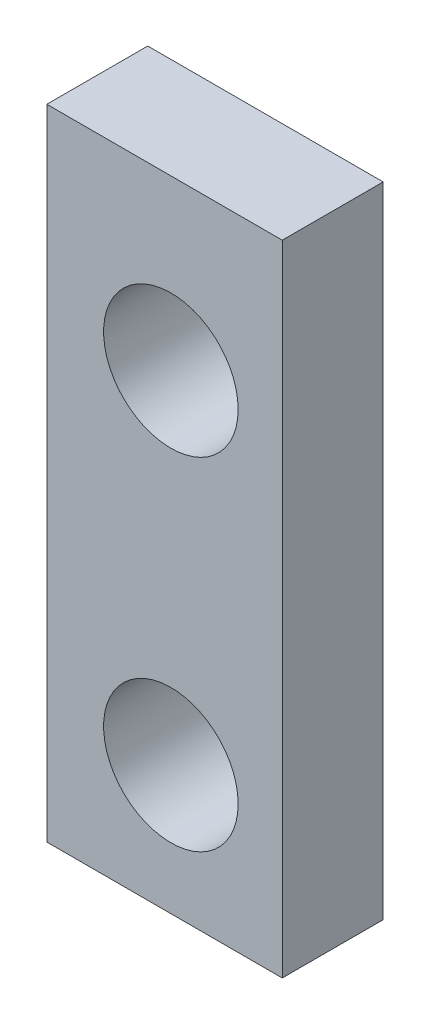
ISO-10303-21;
HEADER;
FILE_DESCRIPTION(('STEP AP214'),'2;1');
FILE_NAME('part.step','',(''),(''),'','','');
FILE_SCHEMA(('AUTOMOTIVE_DESIGN { 1 0 10303 214 1 1 1 1 }'));
ENDSEC;
DATA;
#1=APPLICATION_CONTEXT('core data for automotive mechanical design processes');
#2=APPLICATION_PROTOCOL_DEFINITION('international standard','automotive_design',2000,#1);
#3=PRODUCT_CONTEXT('',#1,'mechanical');
#4=PRODUCT('Part','Part','',(#3));
#5=PRODUCT_RELATED_PRODUCT_CATEGORY('part','',(#4));
#6=PRODUCT_DEFINITION_FORMATION('','',#4);
#7=PRODUCT_DEFINITION_CONTEXT('part definition',#1,'design');
#8=PRODUCT_DEFINITION('design','',#6,#7);
#9=PRODUCT_DEFINITION_SHAPE('','',#8);
#10=(LENGTH_UNIT() NAMED_UNIT(*) SI_UNIT(.MILLI.,.METRE.));
#11=(NAMED_UNIT(*) PLANE_ANGLE_UNIT() SI_UNIT($,.RADIAN.));
#12=(NAMED_UNIT(*) SI_UNIT($,.STERADIAN.) SOLID_ANGLE_UNIT());
#13=UNCERTAINTY_MEASURE_WITH_UNIT(LENGTH_MEASURE(1.E-05),#10,'distance_accuracy_value','');
#14=(GEOMETRIC_REPRESENTATION_CONTEXT(3) GLOBAL_UNCERTAINTY_ASSIGNED_CONTEXT((#13)) GLOBAL_UNIT_ASSIGNED_CONTEXT((#10,
#11,#12)) REPRESENTATION_CONTEXT('',''));
#15=CARTESIAN_POINT('',(0.,0.,0.));
#16=DIRECTION('',(0.,0.,1.));
#17=DIRECTION('',(1.,0.,0.));
#18=AXIS2_PLACEMENT_3D('',#15,#16,#17);
#19=CARTESIAN_POINT('',(0.,0.,3.));
#20=DIRECTION('',(0.,0.,1.));
#21=DIRECTION('',(1.,0.,0.));
#22=AXIS2_PLACEMENT_3D('',#19,#20,#21);
#23=PLANE('',#22);
#24=CARTESIAN_POINT('',(-16.312,21.106,3.));
#25=DIRECTION('',(0.,0.,1.));
#26=DIRECTION('',(1.,0.,0.));
#27=AXIS2_PLACEMENT_3D('',#24,#25,#26);
#28=CIRCLE('',#27,2.);
#29=CARTESIAN_POINT('',(-14.312,21.106,3.));
#30=VERTEX_POINT('',#29);
#31=EDGE_CURVE('E100',#30,#30,#28,.T.);
#32=ORIENTED_EDGE('',*,*,#31,.F.);
#33=EDGE_LOOP('',(#32));
#34=FACE_BOUND('',#33,.T.);
#35=DIRECTION('',(0.,-1.,0.));
#36=VECTOR('',#35,1.);
#37=CARTESIAN_POINT('',(-20.,26.12,3.));
#38=LINE('',#37,#36);
#39=CARTESIAN_POINT('',(-20.,26.12,3.));
#40=VERTEX_POINT('',#39);
#41=CARTESIAN_POINT('',(-20.,7.12,3.));
#42=VERTEX_POINT('',#41);
#43=EDGE_CURVE('E85',#40,#42,#38,.T.);
#44=ORIENTED_EDGE('',*,*,#43,.T.);
#45=DIRECTION('',(1.,0.,0.));
#46=VECTOR('',#45,1.);
#47=CARTESIAN_POINT('',(-20.,7.12,3.));
#48=LINE('',#47,#46);
#49=CARTESIAN_POINT('',(-13.,7.12,3.));
#50=VERTEX_POINT('',#49);
#51=EDGE_CURVE('E80',#42,#50,#48,.T.);
#52=ORIENTED_EDGE('',*,*,#51,.T.);
#53=DIRECTION('',(0.,1.,0.));
#54=VECTOR('',#53,1.);
#55=CARTESIAN_POINT('',(-13.,26.12,3.));
#56=LINE('',#55,#54);
#57=CARTESIAN_POINT('',(-13.,26.12,3.));
#58=VERTEX_POINT('',#57);
#59=EDGE_CURVE('E83',#50,#58,#56,.T.);
#60=ORIENTED_EDGE('',*,*,#59,.T.);
#61=DIRECTION('',(-1.,0.,0.));
#62=VECTOR('',#61,1.);
#63=CARTESIAN_POINT('',(-20.,26.12,3.));
#64=LINE('',#63,#62);
#65=EDGE_CURVE('E50',#58,#40,#64,.T.);
#66=ORIENTED_EDGE('',*,*,#65,.T.);
#67=EDGE_LOOP('',(#44,#52,#60,#66));
#68=FACE_BOUND('',#67,.T.);
#69=CARTESIAN_POINT('',(-16.312,10.946,3.));
#70=DIRECTION('',(0.,0.,1.));
#71=DIRECTION('',(1.,0.,0.));
#72=AXIS2_PLACEMENT_3D('',#69,#70,#71);
#73=CIRCLE('',#72,2.);
#74=CARTESIAN_POINT('',(-14.312,10.946,3.));
#75=VERTEX_POINT('',#74);
#76=EDGE_CURVE('E115',#75,#75,#73,.T.);
#77=ORIENTED_EDGE('',*,*,#76,.F.);
#78=EDGE_LOOP('',(#77));
#79=FACE_BOUND('',#78,.T.);
#80=ADVANCED_FACE('F33',(#34,#68,#79),#23,.T.);
#81=CARTESIAN_POINT('',(0.,0.,0.));
#82=DIRECTION('',(0.,0.,1.));
#83=DIRECTION('',(1.,0.,0.));
#84=AXIS2_PLACEMENT_3D('',#81,#82,#83);
#85=PLANE('',#84);
#86=DIRECTION('',(0.,-1.,0.));
#87=VECTOR('',#86,1.);
#88=CARTESIAN_POINT('',(-20.,26.12,0.));
#89=LINE('',#88,#87);
#90=CARTESIAN_POINT('',(-20.,26.12,0.));
#91=VERTEX_POINT('',#90);
#92=CARTESIAN_POINT('',(-20.,7.12,0.));
#93=VERTEX_POINT('',#92);
#94=EDGE_CURVE('E97',#91,#93,#89,.T.);
#95=ORIENTED_EDGE('',*,*,#94,.F.);
#96=DIRECTION('',(-1.,0.,0.));
#97=VECTOR('',#96,1.);
#98=CARTESIAN_POINT('',(-20.,26.12,0.));
#99=LINE('',#98,#97);
#100=CARTESIAN_POINT('',(-13.,26.12,0.));
#101=VERTEX_POINT('',#100);
#102=EDGE_CURVE('E73',#101,#91,#99,.T.);
#103=ORIENTED_EDGE('',*,*,#102,.F.);
#104=DIRECTION('',(0.,1.,0.));
#105=VECTOR('',#104,1.);
#106=CARTESIAN_POINT('',(-13.,26.12,0.));
#107=LINE('',#106,#105);
#108=CARTESIAN_POINT('',(-13.,7.12,0.));
#109=VERTEX_POINT('',#108);
#110=EDGE_CURVE('E67',#109,#101,#107,.T.);
#111=ORIENTED_EDGE('',*,*,#110,.F.);
#112=DIRECTION('',(1.,0.,0.));
#113=VECTOR('',#112,1.);
#114=CARTESIAN_POINT('',(-20.,7.12,0.));
#115=LINE('',#114,#113);
#116=EDGE_CURVE('E89',#93,#109,#115,.T.);
#117=ORIENTED_EDGE('',*,*,#116,.F.);
#118=EDGE_LOOP('',(#95,#103,#111,#117));
#119=FACE_BOUND('',#118,.T.);
#120=CARTESIAN_POINT('',(-16.312,21.106,0.));
#121=DIRECTION('',(0.,0.,1.));
#122=DIRECTION('',(1.,0.,0.));
#123=AXIS2_PLACEMENT_3D('',#120,#121,#122);
#124=CIRCLE('',#123,2.);
#125=CARTESIAN_POINT('',(-14.312,21.106,0.));
#126=VERTEX_POINT('',#125);
#127=EDGE_CURVE('E112',#126,#126,#124,.T.);
#128=ORIENTED_EDGE('',*,*,#127,.T.);
#129=EDGE_LOOP('',(#128));
#130=FACE_BOUND('',#129,.T.);
#131=CARTESIAN_POINT('',(-16.312,10.946,0.));
#132=DIRECTION('',(0.,0.,1.));
#133=DIRECTION('',(1.,0.,0.));
#134=AXIS2_PLACEMENT_3D('',#131,#132,#133);
#135=CIRCLE('',#134,2.);
#136=CARTESIAN_POINT('',(-14.312,10.946,0.));
#137=VERTEX_POINT('',#136);
#138=EDGE_CURVE('E118',#137,#137,#135,.T.);
#139=ORIENTED_EDGE('',*,*,#138,.T.);
#140=EDGE_LOOP('',(#139));
#141=FACE_BOUND('',#140,.T.);
#142=ADVANCED_FACE('F108',(#119,#130,#141),#85,.F.);
#143=CARTESIAN_POINT('',(-20.,26.12,3.));
#144=DIRECTION('',(1.,0.,0.));
#145=DIRECTION('',(0.,1.,0.));
#146=AXIS2_PLACEMENT_3D('',#143,#144,#145);
#147=PLANE('',#146);
#148=ORIENTED_EDGE('',*,*,#94,.T.);
#149=DIRECTION('',(0.,0.,-1.));
#150=VECTOR('',#149,1.);
#151=CARTESIAN_POINT('',(-20.,7.12,3.));
#152=LINE('',#151,#150);
#153=EDGE_CURVE('E11',#42,#93,#152,.T.);
#154=ORIENTED_EDGE('',*,*,#153,.F.);
#155=ORIENTED_EDGE('',*,*,#43,.F.);
#156=DIRECTION('',(0.,0.,-1.));
#157=VECTOR('',#156,1.);
#158=CARTESIAN_POINT('',(-20.,26.12,3.));
#159=LINE('',#158,#157);
#160=EDGE_CURVE('E93',#40,#91,#159,.T.);
#161=ORIENTED_EDGE('',*,*,#160,.T.);
#162=EDGE_LOOP('',(#148,#154,#155,#161));
#163=FACE_BOUND('',#162,.T.);
#164=ADVANCED_FACE('F35',(#163),#147,.F.);
#165=CARTESIAN_POINT('',(-20.,7.12,3.));
#166=DIRECTION('',(0.,1.,0.));
#167=DIRECTION('',(0.,0.,1.));
#168=AXIS2_PLACEMENT_3D('',#165,#166,#167);
#169=PLANE('',#168);
#170=ORIENTED_EDGE('',*,*,#116,.T.);
#171=DIRECTION('',(0.,0.,-1.));
#172=VECTOR('',#171,1.);
#173=CARTESIAN_POINT('',(-13.,7.12,3.));
#174=LINE('',#173,#172);
#175=EDGE_CURVE('E42',#50,#109,#174,.T.);
#176=ORIENTED_EDGE('',*,*,#175,.F.);
#177=ORIENTED_EDGE('',*,*,#51,.F.);
#178=ORIENTED_EDGE('',*,*,#153,.T.);
#179=EDGE_LOOP('',(#170,#176,#177,#178));
#180=FACE_BOUND('',#179,.T.);
#181=ADVANCED_FACE('F88',(#180),#169,.F.);
#182=CARTESIAN_POINT('',(-13.,26.12,3.));
#183=DIRECTION('',(-1.,0.,0.));
#184=DIRECTION('',(0.,0.,1.));
#185=AXIS2_PLACEMENT_3D('',#182,#183,#184);
#186=PLANE('',#185);
#187=ORIENTED_EDGE('',*,*,#110,.T.);
#188=DIRECTION('',(0.,0.,-1.));
#189=VECTOR('',#188,1.);
#190=CARTESIAN_POINT('',(-13.,26.12,3.));
#191=LINE('',#190,#189);
#192=EDGE_CURVE('E90',#58,#101,#191,.T.);
#193=ORIENTED_EDGE('',*,*,#192,.F.);
#194=ORIENTED_EDGE('',*,*,#59,.F.);
#195=ORIENTED_EDGE('',*,*,#175,.T.);
#196=EDGE_LOOP('',(#187,#193,#194,#195));
#197=FACE_BOUND('',#196,.T.);
#198=ADVANCED_FACE('F91',(#197),#186,.F.);
#199=CARTESIAN_POINT('',(-20.,26.12,3.));
#200=DIRECTION('',(0.,-1.,0.));
#201=DIRECTION('',(0.,0.,-1.));
#202=AXIS2_PLACEMENT_3D('',#199,#200,#201);
#203=PLANE('',#202);
#204=ORIENTED_EDGE('',*,*,#102,.T.);
#205=ORIENTED_EDGE('',*,*,#160,.F.);
#206=ORIENTED_EDGE('',*,*,#65,.F.);
#207=ORIENTED_EDGE('',*,*,#192,.T.);
#208=EDGE_LOOP('',(#204,#205,#206,#207));
#209=FACE_BOUND('',#208,.T.);
#210=ADVANCED_FACE('F105',(#209),#203,.F.);
#211=CARTESIAN_POINT('',(-16.312,21.106,3.));
#212=DIRECTION('',(0.,0.,-1.));
#213=DIRECTION('',(-1.,0.,0.));
#214=AXIS2_PLACEMENT_3D('',#211,#212,#213);
#215=CYLINDRICAL_SURFACE('',#214,2.);
#216=ORIENTED_EDGE('',*,*,#31,.T.);
#217=EDGE_LOOP('',(#216));
#218=FACE_BOUND('',#217,.T.);
#219=ORIENTED_EDGE('',*,*,#127,.F.);
#220=EDGE_LOOP('',(#219));
#221=FACE_BOUND('',#220,.T.);
#222=ADVANCED_FACE('F135',(#218,#221),#215,.F.);
#223=CARTESIAN_POINT('',(-16.312,10.946,3.));
#224=DIRECTION('',(0.,0.,-1.));
#225=DIRECTION('',(-1.,0.,0.));
#226=AXIS2_PLACEMENT_3D('',#223,#224,#225);
#227=CYLINDRICAL_SURFACE('',#226,2.);
#228=ORIENTED_EDGE('',*,*,#76,.T.);
#229=EDGE_LOOP('',(#228));
#230=FACE_BOUND('',#229,.T.);
#231=ORIENTED_EDGE('',*,*,#138,.F.);
#232=EDGE_LOOP('',(#231));
#233=FACE_BOUND('',#232,.T.);
#234=ADVANCED_FACE('F124',(#230,#233),#227,.F.);
#235=CLOSED_SHELL('',(#80,#142,#164,#181,#198,#210,#222,#234));
#236=MANIFOLD_SOLID_BREP('B2',#235);
#237=ADVANCED_BREP_SHAPE_REPRESENTATION('',(#18,#236),#14);
#238=SHAPE_DEFINITION_REPRESENTATION(#9,#237);
ENDSEC;
END-ISO-10303-21;
